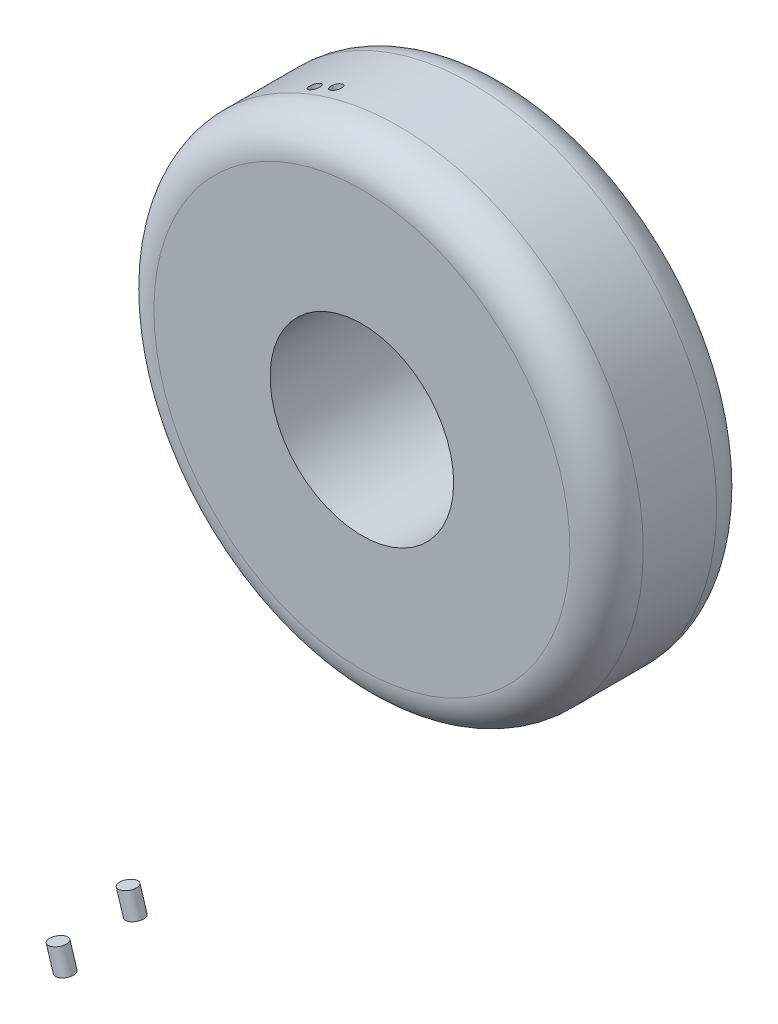
ISO-10303-21;
HEADER;
FILE_DESCRIPTION(('STEP AP214'),'2;1');
FILE_NAME('part.step','',(''),(''),'','','');
FILE_SCHEMA(('AUTOMOTIVE_DESIGN { 1 0 10303 214 1 1 1 1 }'));
ENDSEC;
DATA;
#1=APPLICATION_CONTEXT('core data for automotive mechanical design processes');
#2=APPLICATION_PROTOCOL_DEFINITION('international standard','automotive_design',2000,#1);
#3=PRODUCT_CONTEXT('',#1,'mechanical');
#4=PRODUCT('Part','Part','',(#3));
#5=PRODUCT_RELATED_PRODUCT_CATEGORY('part','',(#4));
#6=PRODUCT_DEFINITION_FORMATION('','',#4);
#7=PRODUCT_DEFINITION_CONTEXT('part definition',#1,'design');
#8=PRODUCT_DEFINITION('design','',#6,#7);
#9=PRODUCT_DEFINITION_SHAPE('','',#8);
#10=(LENGTH_UNIT() NAMED_UNIT(*) SI_UNIT(.MILLI.,.METRE.));
#11=(NAMED_UNIT(*) PLANE_ANGLE_UNIT() SI_UNIT($,.RADIAN.));
#12=(NAMED_UNIT(*) SI_UNIT($,.STERADIAN.) SOLID_ANGLE_UNIT());
#13=UNCERTAINTY_MEASURE_WITH_UNIT(LENGTH_MEASURE(1.E-05),#10,'distance_accuracy_value','');
#14=(GEOMETRIC_REPRESENTATION_CONTEXT(3) GLOBAL_UNCERTAINTY_ASSIGNED_CONTEXT((#13)) GLOBAL_UNIT_ASSIGNED_CONTEXT((#10,
#11,#12)) REPRESENTATION_CONTEXT('',''));
#15=CARTESIAN_POINT('',(0.,0.,0.));
#16=DIRECTION('',(0.,0.,1.));
#17=DIRECTION('',(1.,0.,0.));
#18=AXIS2_PLACEMENT_3D('',#15,#16,#17);
#19=CARTESIAN_POINT('',(1.95284387957973,-9.80746658453867,0.));
#20=DIRECTION('',(0.195284387933704,-0.980746658331987,0.));
#21=DIRECTION('',(0.980746658331987,0.195284387933704,0.));
#22=AXIS2_PLACEMENT_3D('',#19,#20,#21);
#23=PLANE('',#22);
#24=CARTESIAN_POINT('',(2.11698953624257,-9.7747822171528,17.5363227870646));
#25=DIRECTION('',(0.195284380651567,-0.980746659781992,0.));
#26=DIRECTION('',(0.980746659781992,0.195284380651568,0.));
#27=AXIS2_PLACEMENT_3D('',#24,#25,#26);
#28=CIRCLE('',#27,0.347373879064142);
#29=CARTESIAN_POINT('',(2.45767530783024,-9.70694552432523,17.5363227870646));
#30=VERTEX_POINT('',#29);
#31=EDGE_CURVE('E53',#30,#30,#28,.T.);
#32=ORIENTED_EDGE('',*,*,#31,.F.);
#33=EDGE_LOOP('',(#32));
#34=FACE_BOUND('',#33,.T.);
#35=ADVANCED_FACE('F47',(#34),#23,.F.);
#36=CARTESIAN_POINT('',(2.25016847000562,-10.7622430442024,0.));
#37=DIRECTION('',(0.195284387933704,-0.980746658331987,0.));
#38=DIRECTION('',(0.980746658331987,0.195284387933704,0.));
#39=AXIS2_PLACEMENT_3D('',#36,#37,#38);
#40=PLANE('',#39);
#41=CARTESIAN_POINT('',(2.41431412666846,-10.7295586768166,17.5363227870646));
#42=DIRECTION('',(0.195284380651567,-0.980746659781992,0.));
#43=DIRECTION('',(0.980746659781992,0.195284380651568,0.));
#44=AXIS2_PLACEMENT_3D('',#41,#42,#43);
#45=CIRCLE('',#44,0.347373879064142);
#46=CARTESIAN_POINT('',(2.75499989825613,-10.661721983989,17.5363227870646));
#47=VERTEX_POINT('',#46);
#48=EDGE_CURVE('E12',#47,#47,#45,.T.);
#49=ORIENTED_EDGE('',*,*,#48,.T.);
#50=EDGE_LOOP('',(#49));
#51=FACE_BOUND('',#50,.T.);
#52=ADVANCED_FACE('F63',(#51),#40,.T.);
#53=DIRECTION('',(0.297324590425893,-0.954776459663766,0.));
#54=VECTOR('',#53,1.);
#55=SURFACE_OF_LINEAR_EXTRUSION('',#28,#54);
#56=ORIENTED_EDGE('',*,*,#31,.T.);
#57=EDGE_LOOP('',(#56));
#58=FACE_BOUND('',#57,.T.);
#59=ORIENTED_EDGE('',*,*,#48,.F.);
#60=EDGE_LOOP('',(#59));
#61=FACE_BOUND('',#60,.T.);
#62=ADVANCED_FACE('F61',(#58,#61),#55,.T.);
#63=CLOSED_SHELL('',(#35,#52,#62));
#64=MANIFOLD_SOLID_BREP('B2',#63);
#65=CARTESIAN_POINT('',(1.95284387855256,-9.80746657938036,0.));
#66=DIRECTION('',(0.195284387933699,-0.980746658331988,0.));
#67=DIRECTION('',(0.980746658331988,0.195284387933699,0.));
#68=AXIS2_PLACEMENT_3D('',#65,#66,#67);
#69=PLANE('',#68);
#70=CARTESIAN_POINT('',(1.42227877409308,-9.9131116823263,13.9788915176943));
#71=DIRECTION('',(0.195284380651567,-0.980746659781992,0.));
#72=DIRECTION('',(0.980746659781992,0.195284380651567,0.));
#73=AXIS2_PLACEMENT_3D('',#70,#71,#72);
#74=CIRCLE('',#73,0.347373879064142);
#75=CARTESIAN_POINT('',(1.76296454568075,-9.84527498949873,13.9788915176943));
#76=VERTEX_POINT('',#75);
#77=EDGE_CURVE('E118',#76,#76,#74,.T.);
#78=ORIENTED_EDGE('',*,*,#77,.F.);
#79=EDGE_LOOP('',(#78));
#80=FACE_BOUND('',#79,.T.);
#81=ADVANCED_FACE('F112',(#80),#69,.F.);
#82=CARTESIAN_POINT('',(2.25016846897845,-10.7622430390441,0.));
#83=DIRECTION('',(0.195284387933699,-0.980746658331988,0.));
#84=DIRECTION('',(0.980746658331988,0.195284387933699,0.));
#85=AXIS2_PLACEMENT_3D('',#82,#83,#84);
#86=PLANE('',#85);
#87=CARTESIAN_POINT('',(1.71960336451897,-10.8678881419901,13.9788915176943));
#88=DIRECTION('',(0.195284380651567,-0.980746659781992,0.));
#89=DIRECTION('',(0.980746659781992,0.195284380651567,0.));
#90=AXIS2_PLACEMENT_3D('',#87,#88,#89);
#91=CIRCLE('',#90,0.347373879064142);
#92=CARTESIAN_POINT('',(2.06028913610664,-10.8000514491625,13.9788915176943));
#93=VERTEX_POINT('',#92);
#94=EDGE_CURVE('E46',#93,#93,#91,.T.);
#95=ORIENTED_EDGE('',*,*,#94,.T.);
#96=EDGE_LOOP('',(#95));
#97=FACE_BOUND('',#96,.T.);
#98=ADVANCED_FACE('F128',(#97),#86,.T.);
#99=DIRECTION('',(0.297324590425893,-0.954776459663766,0.));
#100=VECTOR('',#99,1.);
#101=SURFACE_OF_LINEAR_EXTRUSION('',#74,#100);
#102=ORIENTED_EDGE('',*,*,#77,.T.);
#103=EDGE_LOOP('',(#102));
#104=FACE_BOUND('',#103,.T.);
#105=ORIENTED_EDGE('',*,*,#94,.F.);
#106=EDGE_LOOP('',(#105));
#107=FACE_BOUND('',#106,.T.);
#108=ADVANCED_FACE('F126',(#104,#107),#101,.T.);
#109=CLOSED_SHELL('',(#81,#98,#108));
#110=MANIFOLD_SOLID_BREP('B7',#109);
#111=CARTESIAN_POINT('',(0.,0.,3.));
#112=DIRECTION('',(0.,0.,-1.));
#113=DIRECTION('',(-1.,0.,0.));
#114=AXIS2_PLACEMENT_3D('',#111,#112,#113);
#115=CYLINDRICAL_SURFACE('',#114,10.);
#116=CARTESIAN_POINT('',(-3.17335749867712,9.48117824063576,0.877668910476359));
#117=DIRECTION('',(-0.311840817054802,0.950134361455575,0.));
#118=DIRECTION('',(-0.950134361455575,-0.311840817054802,0.));
#119=AXIS2_PLACEMENT_3D('',#116,#117,#118);
#120=CIRCLE('',#119,0.225952588871365);
#121=CARTESIAN_POINT('',(-3.11840817054802,9.50134361455575,0.659411703361636));
#122=VERTEX_POINT('',#121);
#123=CARTESIAN_POINT('',(-3.11840817054802,9.50134361455575,1.09592611759108));
#124=VERTEX_POINT('',#123);
#125=EDGE_CURVE('E110',#122,#124,#120,.T.);
#126=ORIENTED_EDGE('',*,*,#125,.F.);
#127=CARTESIAN_POINT('',(-3.17375067454478,9.48244081721046,0.877668910476359));
#128=DIRECTION('',(-0.311840817054802,0.950134361455575,0.));
#129=DIRECTION('',(-0.950134361455575,-0.311840817054802,0.));
#130=AXIS2_PLACEMENT_3D('',#127,#128,#129);
#131=CIRCLE('',#130,0.225952588871365);
#132=EDGE_CURVE('E181',#124,#122,#131,.T.);
#133=ORIENTED_EDGE('',*,*,#132,.F.);
#134=EDGE_LOOP('',(#126,#133));
#135=FACE_BOUND('',#134,.T.);
#136=CARTESIAN_POINT('',(0.,0.,-1.5));
#137=DIRECTION('',(0.,0.,1.));
#138=DIRECTION('',(1.,0.,0.));
#139=AXIS2_PLACEMENT_3D('',#136,#137,#138);
#140=CIRCLE('',#139,10.);
#141=CARTESIAN_POINT('',(10.,0.,-1.5));
#142=VERTEX_POINT('',#141);
#143=EDGE_CURVE('E232',#142,#142,#140,.T.);
#144=ORIENTED_EDGE('',*,*,#143,.T.);
#145=EDGE_LOOP('',(#144));
#146=FACE_BOUND('',#145,.T.);
#147=CARTESIAN_POINT('',(0.,0.,1.5));
#148=DIRECTION('',(0.,0.,1.));
#149=DIRECTION('',(1.,0.,0.));
#150=AXIS2_PLACEMENT_3D('',#147,#148,#149);
#151=CIRCLE('',#150,10.);
#152=CARTESIAN_POINT('',(10.,0.,1.5));
#153=VERTEX_POINT('',#152);
#154=EDGE_CURVE('E233',#153,#153,#151,.F.);
#155=ORIENTED_EDGE('',*,*,#154,.T.);
#156=EDGE_LOOP('',(#155));
#157=FACE_BOUND('',#156,.T.);
#158=CARTESIAN_POINT('',(-4.11521346444677,9.11400121472649,1.02461288365361));
#159=CARTESIAN_POINT('',(-4.11521295000245,9.11400147086537,1.03719459686044));
#160=CARTESIAN_POINT('',(-4.11425522745915,9.11443407248122,1.04978731499476));
#161=CARTESIAN_POINT('',(-4.11045123219475,9.11615022020445,1.07461181350497));
#162=CARTESIAN_POINT('',(-4.10760594206245,9.11743332357587,1.08684377821566));
#163=CARTESIAN_POINT('',(-4.10010844164229,9.1208073973799,1.11062443297982));
#164=CARTESIAN_POINT('',(-4.09545626114071,9.12289835449517,1.12217313429316));
#165=CARTESIAN_POINT('',(-4.08447433524694,9.12782041048197,1.14427080813171));
#166=CARTESIAN_POINT('',(-4.07814462640197,9.13065149322884,1.15481980243009));
#167=CARTESIAN_POINT('',(-4.06398152339907,9.1369641629189,1.17463501334447));
#168=CARTESIAN_POINT('',(-4.05614816436271,9.14044573466822,1.18390125991361));
#169=CARTESIAN_POINT('',(-4.03918991272555,9.14795226563931,1.20090482533569));
#170=CARTESIAN_POINT('',(-4.03006504762046,9.15197721329273,1.20864217672986));
#171=CARTESIAN_POINT('',(-4.01076805454136,9.16045034351098,1.22238451155947));
#172=CARTESIAN_POINT('',(-4.00059594368921,9.16489851915622,1.22838952331152));
#173=CARTESIAN_POINT('',(-3.979474689217,9.17408925808575,1.23850986244064));
#174=CARTESIAN_POINT('',(-3.96852555313495,9.17883181851415,1.24262520814665));
#175=CARTESIAN_POINT('',(-3.94614036778903,9.18847782008466,1.24885790796358));
#176=CARTESIAN_POINT('',(-3.93470431979288,9.19338126080791,1.2509752672761));
#177=CARTESIAN_POINT('',(-3.91164906830589,9.20321457943033,1.25315495924154));
#178=CARTESIAN_POINT('',(-3.9000298641117,9.20814445743098,1.25321728400075));
#179=CARTESIAN_POINT('',(-3.87691896988489,9.21789871068841,1.2512828891998));
#180=CARTESIAN_POINT('',(-3.86542728098216,9.22272308501071,1.2492861514094));
#181=CARTESIAN_POINT('',(-3.84288159207,9.23214007670435,1.24328359639085));
#182=CARTESIAN_POINT('',(-3.83182759733377,9.2367326912837,1.23927775496554));
#183=CARTESIAN_POINT('',(-3.81045888674739,9.24556849918589,1.22936076846455));
#184=CARTESIAN_POINT('',(-3.80014418080129,9.24981168782766,1.2234495978695));
#185=CARTESIAN_POINT('',(-3.78053850458704,9.25784213494139,1.209877877739));
#186=CARTESIAN_POINT('',(-3.77124754780613,9.26162938740672,1.20221730516037));
#187=CARTESIAN_POINT('',(-3.75394808990939,9.2686547608224,1.18535148173772));
#188=CARTESIAN_POINT('',(-3.74593960393901,9.27189287528767,1.17614621265409));
#189=CARTESIAN_POINT('',(-3.73142989968335,9.27774176548901,1.15643935874299));
#190=CARTESIAN_POINT('',(-3.72492869611123,9.28035253510133,1.1459377612631));
#191=CARTESIAN_POINT('',(-3.71361719208051,9.2848847396891,1.12392357426044));
#192=CARTESIAN_POINT('',(-3.70880690416088,9.28680616955274,1.1124109772414));
#193=CARTESIAN_POINT('',(-3.70101370362047,9.28991470794606,1.08868907239269));
#194=CARTESIAN_POINT('',(-3.69803080018725,9.29110181278378,1.07647976106048));
#195=CARTESIAN_POINT('',(-3.69397723310928,9.29271419027867,1.05169870059238));
#196=CARTESIAN_POINT('',(-3.6929065746558,9.29313946086767,1.03912695047265));
#197=CARTESIAN_POINT('',(-3.69270800338681,9.2932183669749,1.01396569038795));
#198=CARTESIAN_POINT('',(-3.69358009150548,9.29287200212208,1.00137618041444));
#199=CARTESIAN_POINT('',(-3.69724217535018,9.29141561456506,0.976524590339056));
#200=CARTESIAN_POINT('',(-3.70003216774685,9.2903055931865,0.964262509668816));
#201=CARTESIAN_POINT('',(-3.70745068001007,9.28734759176095,0.940401571912825));
#202=CARTESIAN_POINT('',(-3.71207919250477,9.28549961467291,0.928802712167995));
#203=CARTESIAN_POINT('',(-3.723043393912,9.28110891044436,0.90658498194768));
#204=CARTESIAN_POINT('',(-3.72937907194763,9.27856618773031,0.895966105228984));
#205=CARTESIAN_POINT('',(-3.74357855699072,9.27284627267536,0.875997033627013));
#206=CARTESIAN_POINT('',(-3.75144235061492,9.2696690858911,0.866646827633913));
#207=CARTESIAN_POINT('',(-3.76847715939291,9.26275683634066,0.849467597055441));
#208=CARTESIAN_POINT('',(-3.77764816019884,9.25902177969763,0.841638555776062));
#209=CARTESIAN_POINT('',(-3.79704176689409,9.25108552707942,0.827711109111841));
#210=CARTESIAN_POINT('',(-3.80726435943651,9.2468843370204,0.821612681765594));
#211=CARTESIAN_POINT('',(-3.82847892312801,9.23812105986208,0.81130758102531));
#212=CARTESIAN_POINT('',(-3.83947088391427,9.23355897762361,0.807100882156763));
#213=CARTESIAN_POINT('',(-3.86192393204313,9.22419055715843,0.800688461258662));
#214=CARTESIAN_POINT('',(-3.87338501335728,9.2193842220703,0.798482713524269));
#215=CARTESIAN_POINT('',(-3.89646660490062,9.20965280730961,0.796127689306683));
#216=CARTESIAN_POINT('',(-3.90808711345853,9.20472772888144,0.795978391282131));
#217=CARTESIAN_POINT('',(-3.93117657364486,9.19489033356926,0.79773772060544));
#218=CARTESIAN_POINT('',(-3.94264552621728,9.18997801660592,0.799646335128924));
#219=CARTESIAN_POINT('',(-3.96512708802226,9.18030048649477,0.805469781471098));
#220=CARTESIAN_POINT('',(-3.97613969740895,9.17553527329727,0.809384612612181));
#221=CARTESIAN_POINT('',(-3.99741677696863,9.16628571454123,0.819117282554886));
#222=CARTESIAN_POINT('',(-4.00768124220833,9.16180137083479,0.824935133903712));
#223=CARTESIAN_POINT('',(-4.0271895205949,9.15324304147975,0.838321461388345));
#224=CARTESIAN_POINT('',(-4.03643331987316,9.14916906140717,0.845889961307293));
#225=CARTESIAN_POINT('',(-4.05365307800397,9.14155268692442,0.862578469574699));
#226=CARTESIAN_POINT('',(-4.06162901222582,9.13801030284159,0.871698508057637));
#227=CARTESIAN_POINT('',(-4.07609740771257,9.1315657380589,0.891249020509238));
#228=CARTESIAN_POINT('',(-4.0825898350488,9.12866357200125,0.901679524440557));
#229=CARTESIAN_POINT('',(-4.0939129220709,9.12359115619108,0.92356813375741));
#230=CARTESIAN_POINT('',(-4.09874354363317,9.1214209232299,0.935026262710157));
#231=CARTESIAN_POINT('',(-4.10674816042163,9.11781990360265,0.959085365177599));
#232=CARTESIAN_POINT('',(-4.10985780456639,9.11641785791182,0.971712378572097));
#233=CARTESIAN_POINT('',(-4.11303584517665,9.11498421917272,0.991111929552471));
#234=CARTESIAN_POINT('',(-4.11384780101684,9.11461774433607,0.997747797470797));
#235=CARTESIAN_POINT('',(-4.11493888969401,9.11412520735439,1.01112540227634));
#236=CARTESIAN_POINT('',(-4.11521374025124,9.11400107740502,1.0178675614146));
#237=CARTESIAN_POINT('',(-4.11521346444677,9.11400121472649,1.02461288365361));
#238=B_SPLINE_CURVE_WITH_KNOTS('',3,(#158,#159,#160,#161,#162,#163,#164,#165,#166,#167,#168,
#169,#170,#171,#172,#173,#174,#175,#176,#177,#178,#179,#180,#181,#182,#183,#184,#185,#186,#187,
#188,#189,#190,#191,#192,#193,#194,#195,#196,#197,#198,#199,#200,#201,#202,#203,#204,#205,#206,
#207,#208,#209,#210,#211,#212,#213,#214,#215,#216,#217,#218,#219,#220,#221,#222,#223,#224,#225,
#226,#227,#228,#229,#230,#231,#232,#233,#234,#235,#236,#237),.UNSPECIFIED.,.T.,.F.,(4,2,2,2,2,2,
2,2,2,2,2,2,2,2,2,2,2,2,2,2,2,2,2,2,2,2,2,2,2,2,2,2,2,2,2,2,2,2,2,4),(0.,0.0377207125298842,
0.0754218046249708,0.113122275250475,0.150821924587762,0.188520693460812,0.226218659861065,
0.26391601002009,0.301612994523491,0.33930988088558,0.377006912047355,0.414704276968517,
0.452402095918486,0.490100419801935,0.527799240277518,0.565498505927828,0.603198139559562,
0.640898052746686,0.678598155476214,0.71629836055192,0.753998583755944,0.791698741515056,
0.82939874811076,0.8670985145132,0.904797950755281,0.942496973241898,0.980195517308402,
1.01789355370125,1.05559110580656,1.09328826302884,1.13098518533361,1.16868209490611,
1.20637925303107,1.24407692331449,1.2817753258578,1.31947459049929,1.35717471994445,
1.39620288516613,1.41626643390818,1.43648930474591),.UNSPECIFIED.);
#239=CARTESIAN_POINT('',(-4.11521346444677,9.11400121472649,1.02461288365361));
#240=VERTEX_POINT('',#239);
#241=EDGE_CURVE('E172',#240,#240,#238,.T.);
#242=ORIENTED_EDGE('',*,*,#241,.F.);
#243=EDGE_LOOP('',(#242));
#244=FACE_BOUND('',#243,.T.);
#245=ADVANCED_FACE('F168',(#135,#146,#157,#244),#115,.T.);
#246=CARTESIAN_POINT('',(0.,0.,3.));
#247=DIRECTION('',(0.,0.,1.));
#248=DIRECTION('',(1.,0.,0.));
#249=AXIS2_PLACEMENT_3D('',#246,#247,#248);
#250=PLANE('',#249);
#251=CARTESIAN_POINT('',(0.,0.,3.));
#252=DIRECTION('',(0.,0.,1.));
#253=DIRECTION('',(1.,0.,0.));
#254=AXIS2_PLACEMENT_3D('',#251,#252,#253);
#255=CIRCLE('',#254,8.5);
#256=CARTESIAN_POINT('',(8.5,0.,3.));
#257=VERTEX_POINT('',#256);
#258=EDGE_CURVE('E192',#257,#257,#255,.T.);
#259=ORIENTED_EDGE('',*,*,#258,.T.);
#260=EDGE_LOOP('',(#259));
#261=FACE_BOUND('',#260,.T.);
#262=CARTESIAN_POINT('',(0.,0.,3.));
#263=DIRECTION('',(0.,0.,1.));
#264=DIRECTION('',(1.,0.,0.));
#265=AXIS2_PLACEMENT_3D('',#262,#263,#264);
#266=CIRCLE('',#265,3.75);
#267=CARTESIAN_POINT('',(3.75,0.,3.));
#268=VERTEX_POINT('',#267);
#269=EDGE_CURVE('E237',#268,#268,#266,.T.);
#270=ORIENTED_EDGE('',*,*,#269,.F.);
#271=EDGE_LOOP('',(#270));
#272=FACE_BOUND('',#271,.T.);
#273=ADVANCED_FACE('F210',(#261,#272),#250,.T.);
#274=CARTESIAN_POINT('',(0.,0.,-3.));
#275=DIRECTION('',(0.,0.,1.));
#276=DIRECTION('',(1.,0.,0.));
#277=AXIS2_PLACEMENT_3D('',#274,#275,#276);
#278=PLANE('',#277);
#279=CARTESIAN_POINT('',(0.,0.,-3.));
#280=DIRECTION('',(0.,0.,1.));
#281=DIRECTION('',(1.,0.,0.));
#282=AXIS2_PLACEMENT_3D('',#279,#280,#281);
#283=CIRCLE('',#282,8.5);
#284=CARTESIAN_POINT('',(8.5,0.,-3.));
#285=VERTEX_POINT('',#284);
#286=EDGE_CURVE('E229',#285,#285,#283,.F.);
#287=ORIENTED_EDGE('',*,*,#286,.T.);
#288=EDGE_LOOP('',(#287));
#289=FACE_BOUND('',#288,.T.);
#290=CARTESIAN_POINT('',(0.,0.,-3.));
#291=DIRECTION('',(0.,0.,1.));
#292=DIRECTION('',(1.,0.,0.));
#293=AXIS2_PLACEMENT_3D('',#290,#291,#292);
#294=CIRCLE('',#293,3.75);
#295=CARTESIAN_POINT('',(3.75,0.,-3.));
#296=VERTEX_POINT('',#295);
#297=EDGE_CURVE('E249',#296,#296,#294,.T.);
#298=ORIENTED_EDGE('',*,*,#297,.T.);
#299=EDGE_LOOP('',(#298));
#300=FACE_BOUND('',#299,.T.);
#301=ADVANCED_FACE('F211',(#289,#300),#278,.F.);
#302=CARTESIAN_POINT('',(0.,0.,3.));
#303=DIRECTION('',(0.,0.,-1.));
#304=DIRECTION('',(-1.,0.,0.));
#305=AXIS2_PLACEMENT_3D('',#302,#303,#304);
#306=CYLINDRICAL_SURFACE('',#305,3.75);
#307=ORIENTED_EDGE('',*,*,#269,.T.);
#308=EDGE_LOOP('',(#307));
#309=FACE_BOUND('',#308,.T.);
#310=ORIENTED_EDGE('',*,*,#297,.F.);
#311=EDGE_LOOP('',(#310));
#312=FACE_BOUND('',#311,.T.);
#313=ADVANCED_FACE('F217',(#309,#312),#306,.F.);
#314=CARTESIAN_POINT('',(0.,0.,-1.5));
#315=DIRECTION('',(0.,0.,1.));
#316=DIRECTION('',(1.,0.,0.));
#317=AXIS2_PLACEMENT_3D('',#314,#315,#316);
#318=TOROIDAL_SURFACE('',#317,8.5,1.5);
#319=ORIENTED_EDGE('',*,*,#286,.F.);
#320=EDGE_LOOP('',(#319));
#321=FACE_BOUND('',#320,.T.);
#322=ORIENTED_EDGE('',*,*,#143,.F.);
#323=EDGE_LOOP('',(#322));
#324=FACE_BOUND('',#323,.T.);
#325=ADVANCED_FACE('F213',(#321,#324),#318,.T.);
#326=CARTESIAN_POINT('',(0.,0.,1.5));
#327=DIRECTION('',(0.,0.,1.));
#328=DIRECTION('',(1.,0.,0.));
#329=AXIS2_PLACEMENT_3D('',#326,#327,#328);
#330=TOROIDAL_SURFACE('',#329,8.5,1.5);
#331=ORIENTED_EDGE('',*,*,#154,.F.);
#332=EDGE_LOOP('',(#331));
#333=FACE_BOUND('',#332,.T.);
#334=ORIENTED_EDGE('',*,*,#258,.F.);
#335=EDGE_LOOP('',(#334));
#336=FACE_BOUND('',#335,.T.);
#337=ADVANCED_FACE('F170',(#333,#336),#330,.T.);
#338=CARTESIAN_POINT('',(-3.17395946395177,9.48311128718582,0.877668910476359));
#339=DIRECTION('',(-0.311840817054802,0.950134361455575,0.));
#340=DIRECTION('',(-0.950134361455575,-0.311840817054802,0.));
#341=AXIS2_PLACEMENT_3D('',#338,#339,#340);
#342=CIRCLE('',#341,0.225952588871365);
#343=DIRECTION('',(0.297324590425893,-0.954776459663766,0.));
#344=VECTOR('',#343,1.);
#345=SURFACE_OF_LINEAR_EXTRUSION('',#342,#344);
#346=CARTESIAN_POINT('',(-3.02529716873882,9.00572305735394,0.877668910476359));
#347=DIRECTION('',(-0.311840817054802,0.950134361455575,0.));
#348=DIRECTION('',(-0.950134361455575,-0.311840817054802,0.));
#349=AXIS2_PLACEMENT_3D('',#346,#347,#348);
#350=CIRCLE('',#349,0.225952588871365);
#351=CARTESIAN_POINT('',(-3.23998248748535,8.93526181742465,0.877668910476359));
#352=VERTEX_POINT('',#351);
#353=EDGE_CURVE('E252',#352,#352,#350,.T.);
#354=ORIENTED_EDGE('',*,*,#353,.F.);
#355=EDGE_LOOP('',(#354));
#356=FACE_BOUND('',#355,.T.);
#357=ORIENTED_EDGE('',*,*,#125,.T.);
#358=ORIENTED_EDGE('',*,*,#132,.T.);
#359=EDGE_LOOP('',(#357,#358));
#360=FACE_BOUND('',#359,.T.);
#361=ADVANCED_FACE('F189',(#356,#360),#345,.T.);
#362=CARTESIAN_POINT('',(-2.96974599184336,9.02395534723814,0.));
#363=DIRECTION('',(-0.311840828683317,0.950134357639014,0.));
#364=DIRECTION('',(-0.950134357639014,-0.311840828683317,0.));
#365=AXIS2_PLACEMENT_3D('',#362,#363,#364);
#366=PLANE('',#365);
#367=ORIENTED_EDGE('',*,*,#353,.T.);
#368=EDGE_LOOP('',(#367));
#369=FACE_BOUND('',#368,.T.);
#370=ADVANCED_FACE('F267',(#369),#366,.T.);
#371=CARTESIAN_POINT('',(-3.91528325121159,9.23980357735086,1.02461288365361));
#372=DIRECTION('',(-0.311840817054801,0.950134361455576,0.));
#373=DIRECTION('',(-0.950134361455576,-0.311840817054801,0.));
#374=AXIS2_PLACEMENT_3D('',#371,#372,#373);
#375=CIRCLE('',#374,0.228319312967696);
#376=DIRECTION('',(0.297324590425893,-0.954776459663766,0.));
#377=VECTOR('',#376,1.);
#378=SURFACE_OF_LINEAR_EXTRUSION('',#375,#377);
#379=CARTESIAN_POINT('',(-3.76662095599864,8.76241534751897,1.02461288365361));
#380=DIRECTION('',(-0.311840817054801,0.950134361455576,0.));
#381=DIRECTION('',(-0.950134361455576,-0.311840817054801,0.));
#382=AXIS2_PLACEMENT_3D('',#379,#380,#381);
#383=CIRCLE('',#382,0.228319312967696);
#384=CARTESIAN_POINT('',(-3.98355498063318,8.69121606641374,1.02461288365361));
#385=VERTEX_POINT('',#384);
#386=EDGE_CURVE('E273',#385,#385,#383,.T.);
#387=ORIENTED_EDGE('',*,*,#386,.F.);
#388=EDGE_LOOP('',(#387));
#389=FACE_BOUND('',#388,.T.);
#390=ORIENTED_EDGE('',*,*,#241,.T.);
#391=EDGE_LOOP('',(#390));
#392=FACE_BOUND('',#391,.T.);
#393=ADVANCED_FACE('F285',(#389,#392),#378,.T.);
#394=CARTESIAN_POINT('',(-2.96974599482118,9.02395535631106,0.));
#395=DIRECTION('',(-0.311840828683318,0.950134357639014,0.));
#396=DIRECTION('',(-0.950134357639014,-0.311840828683318,0.));
#397=AXIS2_PLACEMENT_3D('',#394,#395,#396);
#398=PLANE('',#397);
#399=ORIENTED_EDGE('',*,*,#386,.T.);
#400=EDGE_LOOP('',(#399));
#401=FACE_BOUND('',#400,.T.);
#402=ADVANCED_FACE('F269',(#401),#398,.T.);
#403=CLOSED_SHELL('',(#245,#273,#301,#313,#325,#337,#361,#370,#393,#402));
#404=MANIFOLD_SOLID_BREP('B41',#403);
#405=ADVANCED_BREP_SHAPE_REPRESENTATION('',(#18,#64,#110,#404),#14);
#406=SHAPE_DEFINITION_REPRESENTATION(#9,#405);
ENDSEC;
END-ISO-10303-21;
